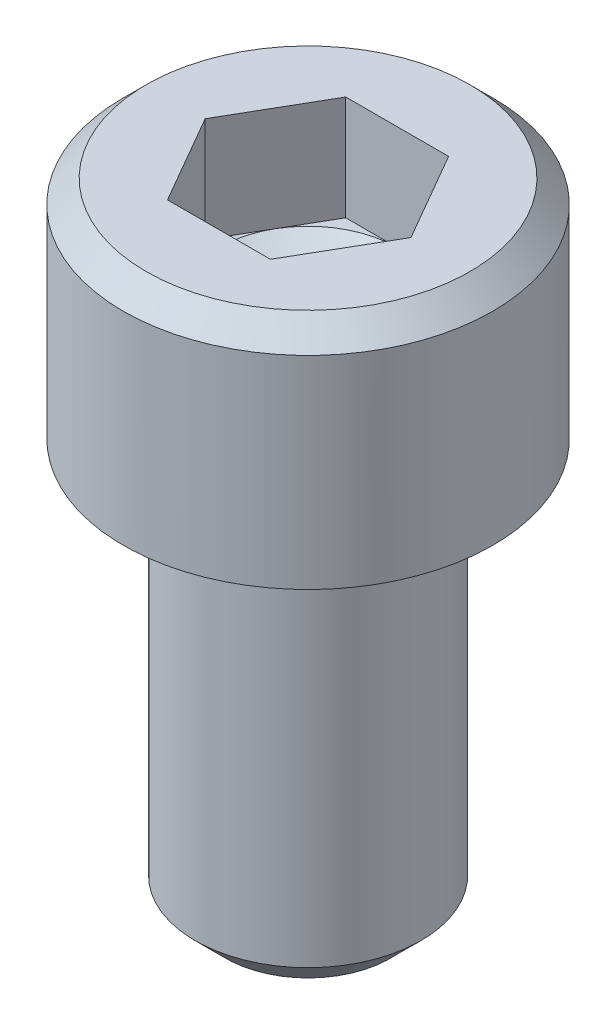
ISO-10303-21;
HEADER;
FILE_DESCRIPTION(('STEP AP214'),'2;1');
FILE_NAME('part.step','',(''),(''),'','','');
FILE_SCHEMA(('AUTOMOTIVE_DESIGN { 1 0 10303 214 1 1 1 1 }'));
ENDSEC;
DATA;
#1=APPLICATION_CONTEXT('core data for automotive mechanical design processes');
#2=APPLICATION_PROTOCOL_DEFINITION('international standard','automotive_design',2000,#1);
#3=PRODUCT_CONTEXT('',#1,'mechanical');
#4=PRODUCT('Part','Part','',(#3));
#5=PRODUCT_RELATED_PRODUCT_CATEGORY('part','',(#4));
#6=PRODUCT_DEFINITION_FORMATION('','',#4);
#7=PRODUCT_DEFINITION_CONTEXT('part definition',#1,'design');
#8=PRODUCT_DEFINITION('design','',#6,#7);
#9=PRODUCT_DEFINITION_SHAPE('','',#8);
#10=(LENGTH_UNIT() NAMED_UNIT(*) SI_UNIT(.MILLI.,.METRE.));
#11=(NAMED_UNIT(*) PLANE_ANGLE_UNIT() SI_UNIT($,.RADIAN.));
#12=(NAMED_UNIT(*) SI_UNIT($,.STERADIAN.) SOLID_ANGLE_UNIT());
#13=UNCERTAINTY_MEASURE_WITH_UNIT(LENGTH_MEASURE(1.E-05),#10,'distance_accuracy_value','');
#14=(GEOMETRIC_REPRESENTATION_CONTEXT(3) GLOBAL_UNCERTAINTY_ASSIGNED_CONTEXT((#13)) GLOBAL_UNIT_ASSIGNED_CONTEXT((#10,
#11,#12)) REPRESENTATION_CONTEXT('',''));
#15=CARTESIAN_POINT('',(0.,0.,0.));
#16=DIRECTION('',(0.,0.,1.));
#17=DIRECTION('',(1.,0.,0.));
#18=AXIS2_PLACEMENT_3D('',#15,#16,#17);
#19=CARTESIAN_POINT('',(0.,1.8796,0.));
#20=DIRECTION('',(0.,1.,0.));
#21=DIRECTION('',(0.,0.,1.));
#22=AXIS2_PLACEMENT_3D('',#19,#20,#21);
#23=PLANE('',#22);
#24=DIRECTION('',(0.500000000000001,0.,-0.866025403784438));
#25=VECTOR('',#24,1.);
#26=CARTESIAN_POINT('',(0.799225977639199,1.8796,1.3843));
#27=LINE('',#26,#25);
#28=CARTESIAN_POINT('',(0.799225977639199,1.8796,1.3843));
#29=VERTEX_POINT('',#28);
#30=CARTESIAN_POINT('',(1.1988389664588,1.87959999978283,0.692150000000002));
#31=VERTEX_POINT('',#30);
#32=EDGE_CURVE('E259',#29,#31,#27,.T.);
#33=ORIENTED_EDGE('',*,*,#32,.T.);
#34=CARTESIAN_POINT('',(0.,1.87959999978283,0.));
#35=DIRECTION('',(0.,-1.,0.));
#36=DIRECTION('',(1.,0.,0.));
#37=AXIS2_PLACEMENT_3D('',#34,#35,#36);
#38=CIRCLE('',#37,1.38430000009762);
#39=CARTESIAN_POINT('',(0.,1.87959999978283,1.38430000009762));
#40=VERTEX_POINT('',#39);
#41=EDGE_CURVE('E48',#31,#40,#38,.T.);
#42=ORIENTED_EDGE('',*,*,#41,.T.);
#43=DIRECTION('',(1.,0.,0.));
#44=VECTOR('',#43,1.);
#45=CARTESIAN_POINT('',(-0.799225977639198,1.8796,1.3843));
#46=LINE('',#45,#44);
#47=EDGE_CURVE('E242',#40,#29,#46,.T.);
#48=ORIENTED_EDGE('',*,*,#47,.T.);
#49=EDGE_LOOP('',(#33,#42,#48));
#50=FACE_BOUND('',#49,.T.);
#51=ADVANCED_FACE('F33',(#50),#23,.T.);
#52=CARTESIAN_POINT('',(-0.799225977639198,1.8796,1.3843));
#53=VERTEX_POINT('',#52);
#54=EDGE_CURVE('E214',#53,#40,#46,.T.);
#55=ORIENTED_EDGE('',*,*,#54,.T.);
#56=CARTESIAN_POINT('',(-1.19883896654334,1.87959999978283,0.692150000048811));
#57=VERTEX_POINT('',#56);
#58=EDGE_CURVE('E201',#40,#57,#38,.T.);
#59=ORIENTED_EDGE('',*,*,#58,.T.);
#60=DIRECTION('',(0.500000000000001,0.,0.866025403784438));
#61=VECTOR('',#60,1.);
#62=CARTESIAN_POINT('',(-1.5984519552784,1.8796,0.));
#63=LINE('',#62,#61);
#64=EDGE_CURVE('E246',#57,#53,#63,.T.);
#65=ORIENTED_EDGE('',*,*,#64,.T.);
#66=EDGE_LOOP('',(#55,#59,#65));
#67=FACE_BOUND('',#66,.T.);
#68=ADVANCED_FACE('F123',(#67),#23,.T.);
#69=CARTESIAN_POINT('',(-1.5984519552784,1.8796,0.));
#70=VERTEX_POINT('',#69);
#71=EDGE_CURVE('E243',#70,#57,#63,.T.);
#72=ORIENTED_EDGE('',*,*,#71,.T.);
#73=CARTESIAN_POINT('',(-1.19883896654334,1.87959999978283,-0.692150000048813));
#74=VERTEX_POINT('',#73);
#75=EDGE_CURVE('E203',#57,#74,#38,.T.);
#76=ORIENTED_EDGE('',*,*,#75,.T.);
#77=DIRECTION('',(-0.500000000000003,0.,0.866025403784437));
#78=VECTOR('',#77,1.);
#79=CARTESIAN_POINT('',(-0.799225977639196,1.8796,-1.3843));
#80=LINE('',#79,#78);
#81=EDGE_CURVE('E250',#74,#70,#80,.T.);
#82=ORIENTED_EDGE('',*,*,#81,.T.);
#83=EDGE_LOOP('',(#72,#76,#82));
#84=FACE_BOUND('',#83,.T.);
#85=ADVANCED_FACE('F128',(#84),#23,.T.);
#86=CARTESIAN_POINT('',(-0.799225977639196,1.8796,-1.3843));
#87=VERTEX_POINT('',#86);
#88=EDGE_CURVE('E247',#87,#74,#80,.T.);
#89=ORIENTED_EDGE('',*,*,#88,.T.);
#90=CARTESIAN_POINT('',(0.,1.87959999978283,-1.38430000009762));
#91=VERTEX_POINT('',#90);
#92=EDGE_CURVE('E264',#74,#91,#38,.T.);
#93=ORIENTED_EDGE('',*,*,#92,.T.);
#94=DIRECTION('',(-1.,0.,0.));
#95=VECTOR('',#94,1.);
#96=CARTESIAN_POINT('',(0.799225977639201,1.8796,-1.3843));
#97=LINE('',#96,#95);
#98=EDGE_CURVE('E254',#91,#87,#97,.T.);
#99=ORIENTED_EDGE('',*,*,#98,.T.);
#100=EDGE_LOOP('',(#89,#93,#99));
#101=FACE_BOUND('',#100,.T.);
#102=ADVANCED_FACE('F276',(#101),#23,.T.);
#103=CARTESIAN_POINT('',(0.799225977639201,1.8796,-1.3843));
#104=VERTEX_POINT('',#103);
#105=EDGE_CURVE('E251',#104,#91,#97,.T.);
#106=ORIENTED_EDGE('',*,*,#105,.T.);
#107=CARTESIAN_POINT('',(1.19883896654334,1.87959999978283,-0.692150000048809));
#108=VERTEX_POINT('',#107);
#109=EDGE_CURVE('E261',#91,#108,#38,.T.);
#110=ORIENTED_EDGE('',*,*,#109,.T.);
#111=DIRECTION('',(-0.5,0.,-0.866025403784439));
#112=VECTOR('',#111,1.);
#113=CARTESIAN_POINT('',(1.5984519552784,1.8796,0.));
#114=LINE('',#113,#112);
#115=EDGE_CURVE('E258',#108,#104,#114,.T.);
#116=ORIENTED_EDGE('',*,*,#115,.T.);
#117=EDGE_LOOP('',(#106,#110,#116));
#118=FACE_BOUND('',#117,.T.);
#119=ADVANCED_FACE('F121',(#118),#23,.T.);
#120=CARTESIAN_POINT('',(0.,3.5052,0.));
#121=DIRECTION('',(0.,-1.,0.));
#122=DIRECTION('',(0.,0.,-1.));
#123=AXIS2_PLACEMENT_3D('',#120,#121,#122);
#124=CYLINDRICAL_SURFACE('',#123,2.8702);
#125=CARTESIAN_POINT('',(0.,3.14960000010227,0.));
#126=DIRECTION('',(0.,1.,0.));
#127=DIRECTION('',(0.,0.,1.));
#128=AXIS2_PLACEMENT_3D('',#125,#126,#127);
#129=CIRCLE('',#128,2.8702);
#130=CARTESIAN_POINT('',(0.,3.14960000010227,2.8702));
#131=VERTEX_POINT('',#130);
#132=EDGE_CURVE('E185',#131,#131,#129,.F.);
#133=ORIENTED_EDGE('',*,*,#132,.T.);
#134=EDGE_LOOP('',(#133));
#135=FACE_BOUND('',#134,.T.);
#136=CARTESIAN_POINT('',(0.,0.,0.));
#137=DIRECTION('',(0.,-1.,0.));
#138=DIRECTION('',(0.,0.,-1.));
#139=AXIS2_PLACEMENT_3D('',#136,#137,#138);
#140=CIRCLE('',#139,2.8702);
#141=CARTESIAN_POINT('',(0.,0.,-2.8702));
#142=VERTEX_POINT('',#141);
#143=EDGE_CURVE('E206',#142,#142,#140,.T.);
#144=ORIENTED_EDGE('',*,*,#143,.F.);
#145=EDGE_LOOP('',(#144));
#146=FACE_BOUND('',#145,.T.);
#147=ADVANCED_FACE('F169',(#135,#146),#124,.T.);
#148=CARTESIAN_POINT('',(2.8702,3.5052,0.));
#149=DIRECTION('',(0.,1.,0.));
#150=DIRECTION('',(0.,0.,1.));
#151=AXIS2_PLACEMENT_3D('',#148,#149,#150);
#152=PLANE('',#151);
#153=CARTESIAN_POINT('',(0.,3.5052,0.));
#154=DIRECTION('',(0.,1.,0.));
#155=DIRECTION('',(0.,0.,1.));
#156=AXIS2_PLACEMENT_3D('',#153,#154,#155);
#157=CIRCLE('',#156,2.51460000004543);
#158=CARTESIAN_POINT('',(0.,3.5052,2.51460000004543));
#159=VERTEX_POINT('',#158);
#160=EDGE_CURVE('E182',#159,#159,#157,.T.);
#161=ORIENTED_EDGE('',*,*,#160,.T.);
#162=EDGE_LOOP('',(#161));
#163=FACE_BOUND('',#162,.T.);
#164=DIRECTION('',(0.500000000000001,0.,-0.866025403784438));
#165=VECTOR('',#164,1.);
#166=CARTESIAN_POINT('',(0.799225977639199,3.5052,1.3843));
#167=LINE('',#166,#165);
#168=CARTESIAN_POINT('',(0.799225977639199,3.5052,1.3843));
#169=VERTEX_POINT('',#168);
#170=CARTESIAN_POINT('',(1.5984519552784,3.5052,0.));
#171=VERTEX_POINT('',#170);
#172=EDGE_CURVE('E56',#169,#171,#167,.T.);
#173=ORIENTED_EDGE('',*,*,#172,.F.);
#174=DIRECTION('',(1.,0.,0.));
#175=VECTOR('',#174,1.);
#176=CARTESIAN_POINT('',(-0.799225977639198,3.5052,1.3843));
#177=LINE('',#176,#175);
#178=CARTESIAN_POINT('',(-0.799225977639198,3.5052,1.3843));
#179=VERTEX_POINT('',#178);
#180=EDGE_CURVE('E223',#179,#169,#177,.T.);
#181=ORIENTED_EDGE('',*,*,#180,.F.);
#182=DIRECTION('',(0.500000000000001,0.,0.866025403784438));
#183=VECTOR('',#182,1.);
#184=CARTESIAN_POINT('',(-1.5984519552784,3.5052,0.));
#185=LINE('',#184,#183);
#186=CARTESIAN_POINT('',(-1.5984519552784,3.5052,0.));
#187=VERTEX_POINT('',#186);
#188=EDGE_CURVE('E227',#187,#179,#185,.T.);
#189=ORIENTED_EDGE('',*,*,#188,.F.);
#190=DIRECTION('',(-0.500000000000003,0.,0.866025403784437));
#191=VECTOR('',#190,1.);
#192=CARTESIAN_POINT('',(-0.799225977639196,3.5052,-1.3843));
#193=LINE('',#192,#191);
#194=CARTESIAN_POINT('',(-0.799225977639196,3.5052,-1.3843));
#195=VERTEX_POINT('',#194);
#196=EDGE_CURVE('E230',#195,#187,#193,.T.);
#197=ORIENTED_EDGE('',*,*,#196,.F.);
#198=DIRECTION('',(-1.,0.,0.));
#199=VECTOR('',#198,1.);
#200=CARTESIAN_POINT('',(0.799225977639201,3.5052,-1.3843));
#201=LINE('',#200,#199);
#202=CARTESIAN_POINT('',(0.799225977639201,3.5052,-1.3843));
#203=VERTEX_POINT('',#202);
#204=EDGE_CURVE('E233',#203,#195,#201,.T.);
#205=ORIENTED_EDGE('',*,*,#204,.F.);
#206=DIRECTION('',(-0.5,0.,-0.866025403784439));
#207=VECTOR('',#206,1.);
#208=CARTESIAN_POINT('',(1.5984519552784,3.5052,0.));
#209=LINE('',#208,#207);
#210=EDGE_CURVE('E236',#171,#203,#209,.T.);
#211=ORIENTED_EDGE('',*,*,#210,.F.);
#212=EDGE_LOOP('',(#173,#181,#189,#197,#205,#211));
#213=FACE_BOUND('',#212,.T.);
#214=ADVANCED_FACE('F165',(#163,#213),#152,.T.);
#215=CARTESIAN_POINT('',(0.,0.,0.));
#216=DIRECTION('',(0.,-1.,0.));
#217=DIRECTION('',(0.,0.,-1.));
#218=AXIS2_PLACEMENT_3D('',#215,#216,#217);
#219=PLANE('',#218);
#220=CARTESIAN_POINT('',(0.,0.,0.));
#221=DIRECTION('',(0.,-1.,0.));
#222=DIRECTION('',(0.,0.,-1.));
#223=AXIS2_PLACEMENT_3D('',#220,#221,#222);
#224=CIRCLE('',#223,2.0066);
#225=CARTESIAN_POINT('',(0.,0.,-2.0066));
#226=VERTEX_POINT('',#225);
#227=EDGE_CURVE('E11',#226,#226,#224,.F.);
#228=ORIENTED_EDGE('',*,*,#227,.T.);
#229=EDGE_LOOP('',(#228));
#230=FACE_BOUND('',#229,.T.);
#231=ORIENTED_EDGE('',*,*,#143,.T.);
#232=EDGE_LOOP('',(#231));
#233=FACE_BOUND('',#232,.T.);
#234=ADVANCED_FACE('F161',(#230,#233),#219,.T.);
#235=CARTESIAN_POINT('',(0.,-6.35,0.));
#236=DIRECTION('',(0.,1.,0.));
#237=DIRECTION('',(0.,0.,1.));
#238=AXIS2_PLACEMENT_3D('',#235,#236,#237);
#239=CYLINDRICAL_SURFACE('',#238,1.7526);
#240=CARTESIAN_POINT('',(0.,-0.254,0.));
#241=DIRECTION('',(0.,-1.,0.));
#242=DIRECTION('',(0.,0.,-1.));
#243=AXIS2_PLACEMENT_3D('',#240,#241,#242);
#244=CIRCLE('',#243,1.7526);
#245=CARTESIAN_POINT('',(0.,-0.254,-1.7526));
#246=VERTEX_POINT('',#245);
#247=EDGE_CURVE('E41',#246,#246,#244,.T.);
#248=ORIENTED_EDGE('',*,*,#247,.T.);
#249=EDGE_LOOP('',(#248));
#250=FACE_BOUND('',#249,.T.);
#251=CARTESIAN_POINT('',(0.,-5.87756000001317,0.));
#252=DIRECTION('',(0.,-1.,0.));
#253=DIRECTION('',(0.,0.,-1.));
#254=AXIS2_PLACEMENT_3D('',#251,#252,#253);
#255=CIRCLE('',#254,1.7526);
#256=CARTESIAN_POINT('',(0.,-5.87756000001317,-1.7526));
#257=VERTEX_POINT('',#256);
#258=EDGE_CURVE('E186',#257,#257,#255,.F.);
#259=ORIENTED_EDGE('',*,*,#258,.T.);
#260=EDGE_LOOP('',(#259));
#261=FACE_BOUND('',#260,.T.);
#262=ADVANCED_FACE('F157',(#250,#261),#239,.T.);
#263=CARTESIAN_POINT('',(0.,-6.35,0.));
#264=DIRECTION('',(0.,-1.,0.));
#265=DIRECTION('',(0.,0.,-1.));
#266=AXIS2_PLACEMENT_3D('',#263,#264,#265);
#267=PLANE('',#266);
#268=CARTESIAN_POINT('',(0.,-6.35,0.));
#269=DIRECTION('',(0.,-1.,0.));
#270=DIRECTION('',(0.,0.,-1.));
#271=AXIS2_PLACEMENT_3D('',#268,#269,#270);
#272=CIRCLE('',#271,1.28016000001318);
#273=CARTESIAN_POINT('',(0.,-6.35,-1.28016000001318));
#274=VERTEX_POINT('',#273);
#275=EDGE_CURVE('E190',#274,#274,#272,.T.);
#276=ORIENTED_EDGE('',*,*,#275,.T.);
#277=EDGE_LOOP('',(#276));
#278=FACE_BOUND('',#277,.T.);
#279=ADVANCED_FACE('F154',(#278),#267,.T.);
#280=CARTESIAN_POINT('',(0.799225977639199,1.8796,1.3843));
#281=DIRECTION('',(0.866025403784438,0.,0.500000000000001));
#282=DIRECTION('',(0.500000000000001,0.,-0.866025403784438));
#283=AXIS2_PLACEMENT_3D('',#280,#281,#282);
#284=PLANE('',#283);
#285=ORIENTED_EDGE('',*,*,#172,.T.);
#286=DIRECTION('',(0.,1.,0.));
#287=VECTOR('',#286,1.);
#288=CARTESIAN_POINT('',(1.5984519552784,1.8796,0.));
#289=LINE('',#288,#287);
#290=CARTESIAN_POINT('',(1.5984519552784,1.8796,0.));
#291=VERTEX_POINT('',#290);
#292=EDGE_CURVE('E211',#291,#171,#289,.T.);
#293=ORIENTED_EDGE('',*,*,#292,.F.);
#294=EDGE_CURVE('E226',#31,#291,#27,.T.);
#295=ORIENTED_EDGE('',*,*,#294,.F.);
#296=ORIENTED_EDGE('',*,*,#32,.F.);
#297=DIRECTION('',(0.,1.,0.));
#298=VECTOR('',#297,1.);
#299=CARTESIAN_POINT('',(0.799225977639199,1.8796,1.3843));
#300=LINE('',#299,#298);
#301=EDGE_CURVE('E210',#29,#169,#300,.T.);
#302=ORIENTED_EDGE('',*,*,#301,.T.);
#303=EDGE_LOOP('',(#285,#293,#295,#296,#302));
#304=FACE_BOUND('',#303,.T.);
#305=ADVANCED_FACE('F136',(#304),#284,.F.);
#306=CARTESIAN_POINT('',(-0.799225977639198,1.8796,1.3843));
#307=DIRECTION('',(0.,0.,1.));
#308=DIRECTION('',(1.,0.,0.));
#309=AXIS2_PLACEMENT_3D('',#306,#307,#308);
#310=PLANE('',#309);
#311=ORIENTED_EDGE('',*,*,#180,.T.);
#312=ORIENTED_EDGE('',*,*,#301,.F.);
#313=ORIENTED_EDGE('',*,*,#47,.F.);
#314=ORIENTED_EDGE('',*,*,#54,.F.);
#315=DIRECTION('',(0.,1.,0.));
#316=VECTOR('',#315,1.);
#317=CARTESIAN_POINT('',(-0.799225977639198,1.8796,1.3843));
#318=LINE('',#317,#316);
#319=EDGE_CURVE('E220',#53,#179,#318,.T.);
#320=ORIENTED_EDGE('',*,*,#319,.T.);
#321=EDGE_LOOP('',(#311,#312,#313,#314,#320));
#322=FACE_BOUND('',#321,.T.);
#323=ADVANCED_FACE('F132',(#322),#310,.F.);
#324=CARTESIAN_POINT('',(-1.5984519552784,1.8796,0.));
#325=DIRECTION('',(-0.866025403784438,0.,0.500000000000001));
#326=DIRECTION('',(0.500000000000001,0.,0.866025403784438));
#327=AXIS2_PLACEMENT_3D('',#324,#325,#326);
#328=PLANE('',#327);
#329=ORIENTED_EDGE('',*,*,#188,.T.);
#330=ORIENTED_EDGE('',*,*,#319,.F.);
#331=ORIENTED_EDGE('',*,*,#64,.F.);
#332=ORIENTED_EDGE('',*,*,#71,.F.);
#333=DIRECTION('',(0.,1.,0.));
#334=VECTOR('',#333,1.);
#335=CARTESIAN_POINT('',(-1.5984519552784,1.8796,0.));
#336=LINE('',#335,#334);
#337=EDGE_CURVE('E218',#70,#187,#336,.T.);
#338=ORIENTED_EDGE('',*,*,#337,.T.);
#339=EDGE_LOOP('',(#329,#330,#331,#332,#338));
#340=FACE_BOUND('',#339,.T.);
#341=ADVANCED_FACE('F135',(#340),#328,.F.);
#342=CARTESIAN_POINT('',(-0.799225977639196,1.8796,-1.3843));
#343=DIRECTION('',(-0.866025403784437,0.,-0.500000000000003));
#344=DIRECTION('',(-0.500000000000003,0.,0.866025403784437));
#345=AXIS2_PLACEMENT_3D('',#342,#343,#344);
#346=PLANE('',#345);
#347=ORIENTED_EDGE('',*,*,#196,.T.);
#348=ORIENTED_EDGE('',*,*,#337,.F.);
#349=ORIENTED_EDGE('',*,*,#81,.F.);
#350=ORIENTED_EDGE('',*,*,#88,.F.);
#351=DIRECTION('',(0.,1.,0.));
#352=VECTOR('',#351,1.);
#353=CARTESIAN_POINT('',(-0.799225977639196,1.8796,-1.3843));
#354=LINE('',#353,#352);
#355=EDGE_CURVE('E216',#87,#195,#354,.T.);
#356=ORIENTED_EDGE('',*,*,#355,.T.);
#357=EDGE_LOOP('',(#347,#348,#349,#350,#356));
#358=FACE_BOUND('',#357,.T.);
#359=ADVANCED_FACE('F140',(#358),#346,.F.);
#360=CARTESIAN_POINT('',(0.799225977639201,1.8796,-1.3843));
#361=DIRECTION('',(0.,0.,-1.));
#362=DIRECTION('',(-1.,0.,0.));
#363=AXIS2_PLACEMENT_3D('',#360,#361,#362);
#364=PLANE('',#363);
#365=ORIENTED_EDGE('',*,*,#204,.T.);
#366=ORIENTED_EDGE('',*,*,#355,.F.);
#367=ORIENTED_EDGE('',*,*,#98,.F.);
#368=ORIENTED_EDGE('',*,*,#105,.F.);
#369=DIRECTION('',(0.,1.,0.));
#370=VECTOR('',#369,1.);
#371=CARTESIAN_POINT('',(0.799225977639201,1.8796,-1.3843));
#372=LINE('',#371,#370);
#373=EDGE_CURVE('E213',#104,#203,#372,.T.);
#374=ORIENTED_EDGE('',*,*,#373,.T.);
#375=EDGE_LOOP('',(#365,#366,#367,#368,#374));
#376=FACE_BOUND('',#375,.T.);
#377=ADVANCED_FACE('F144',(#376),#364,.F.);
#378=CARTESIAN_POINT('',(1.5984519552784,1.8796,0.));
#379=DIRECTION('',(0.866025403784439,0.,-0.5));
#380=DIRECTION('',(-0.5,0.,-0.866025403784439));
#381=AXIS2_PLACEMENT_3D('',#378,#379,#380);
#382=PLANE('',#381);
#383=ORIENTED_EDGE('',*,*,#210,.T.);
#384=ORIENTED_EDGE('',*,*,#373,.F.);
#385=ORIENTED_EDGE('',*,*,#115,.F.);
#386=EDGE_CURVE('E255',#291,#108,#114,.T.);
#387=ORIENTED_EDGE('',*,*,#386,.F.);
#388=ORIENTED_EDGE('',*,*,#292,.T.);
#389=EDGE_LOOP('',(#383,#384,#385,#387,#388));
#390=FACE_BOUND('',#389,.T.);
#391=ADVANCED_FACE('F118',(#390),#382,.F.);
#392=ORIENTED_EDGE('',*,*,#386,.T.);
#393=EDGE_CURVE('E209',#108,#31,#38,.T.);
#394=ORIENTED_EDGE('',*,*,#393,.T.);
#395=ORIENTED_EDGE('',*,*,#294,.T.);
#396=EDGE_LOOP('',(#392,#394,#395));
#397=FACE_BOUND('',#396,.T.);
#398=ADVANCED_FACE('F109',(#397),#23,.T.);
#399=CARTESIAN_POINT('',(0.,1.08037402208727,0.));
#400=DIRECTION('',(0.,1.,0.));
#401=DIRECTION('',(-1.,0.,0.));
#402=AXIS2_PLACEMENT_3D('',#399,#400,#401);
#403=CONICAL_SURFACE('',#402,0.,1.0471975511966);
#404=ORIENTED_EDGE('',*,*,#41,.F.);
#405=ORIENTED_EDGE('',*,*,#393,.F.);
#406=ORIENTED_EDGE('',*,*,#109,.F.);
#407=ORIENTED_EDGE('',*,*,#92,.F.);
#408=ORIENTED_EDGE('',*,*,#75,.F.);
#409=ORIENTED_EDGE('',*,*,#58,.F.);
#410=EDGE_LOOP('',(#404,#405,#406,#407,#408,#409));
#411=FACE_BOUND('',#410,.T.);
#412=CARTESIAN_POINT('',(0.,1.08037402208727,0.));
#413=VERTEX_POINT('',#412);
#414=VERTEX_LOOP('',#413);
#415=FACE_BOUND('',#414,.T.);
#416=ADVANCED_FACE('F106',(#411,#415),#403,.F.);
#417=CARTESIAN_POINT('',(0.,-6.35,0.));
#418=DIRECTION('',(0.,1.,0.));
#419=DIRECTION('',(0.,0.,1.));
#420=AXIS2_PLACEMENT_3D('',#417,#418,#419);
#421=CONICAL_SURFACE('',#420,1.28016000001318,0.785398163397444);
#422=ORIENTED_EDGE('',*,*,#258,.F.);
#423=EDGE_LOOP('',(#422));
#424=FACE_BOUND('',#423,.T.);
#425=ORIENTED_EDGE('',*,*,#275,.F.);
#426=EDGE_LOOP('',(#425));
#427=FACE_BOUND('',#426,.T.);
#428=ADVANCED_FACE('F108',(#424,#427),#421,.T.);
#429=CARTESIAN_POINT('',(0.,3.14960000010227,0.));
#430=DIRECTION('',(0.,-1.,0.));
#431=DIRECTION('',(0.,0.,-1.));
#432=AXIS2_PLACEMENT_3D('',#429,#430,#431);
#433=CONICAL_SURFACE('',#432,2.8702,0.785398163477377);
#434=ORIENTED_EDGE('',*,*,#160,.F.);
#435=EDGE_LOOP('',(#434));
#436=FACE_BOUND('',#435,.T.);
#437=ORIENTED_EDGE('',*,*,#132,.F.);
#438=EDGE_LOOP('',(#437));
#439=FACE_BOUND('',#438,.T.);
#440=ADVANCED_FACE('F115',(#436,#439),#433,.T.);
#441=CARTESIAN_POINT('',(0.,-0.254,0.));
#442=DIRECTION('',(0.,-1.,0.));
#443=DIRECTION('',(0.,0.,-1.));
#444=AXIS2_PLACEMENT_3D('',#441,#442,#443);
#445=TOROIDAL_SURFACE('',#444,2.0066,0.254);
#446=ORIENTED_EDGE('',*,*,#227,.F.);
#447=EDGE_LOOP('',(#446));
#448=FACE_BOUND('',#447,.T.);
#449=ORIENTED_EDGE('',*,*,#247,.F.);
#450=EDGE_LOOP('',(#449));
#451=FACE_BOUND('',#450,.T.);
#452=ADVANCED_FACE('F35',(#448,#451),#445,.F.);
#453=CLOSED_SHELL('',(#51,#68,#85,#102,#119,#147,#214,#234,#262,#279,#305,#323,#341,#359,#377,
#391,#398,#416,#428,#440,#452));
#454=MANIFOLD_SOLID_BREP('B2',#453);
#455=ADVANCED_BREP_SHAPE_REPRESENTATION('',(#18,#454),#14);
#456=SHAPE_DEFINITION_REPRESENTATION(#9,#455);
ENDSEC;
END-ISO-10303-21;
